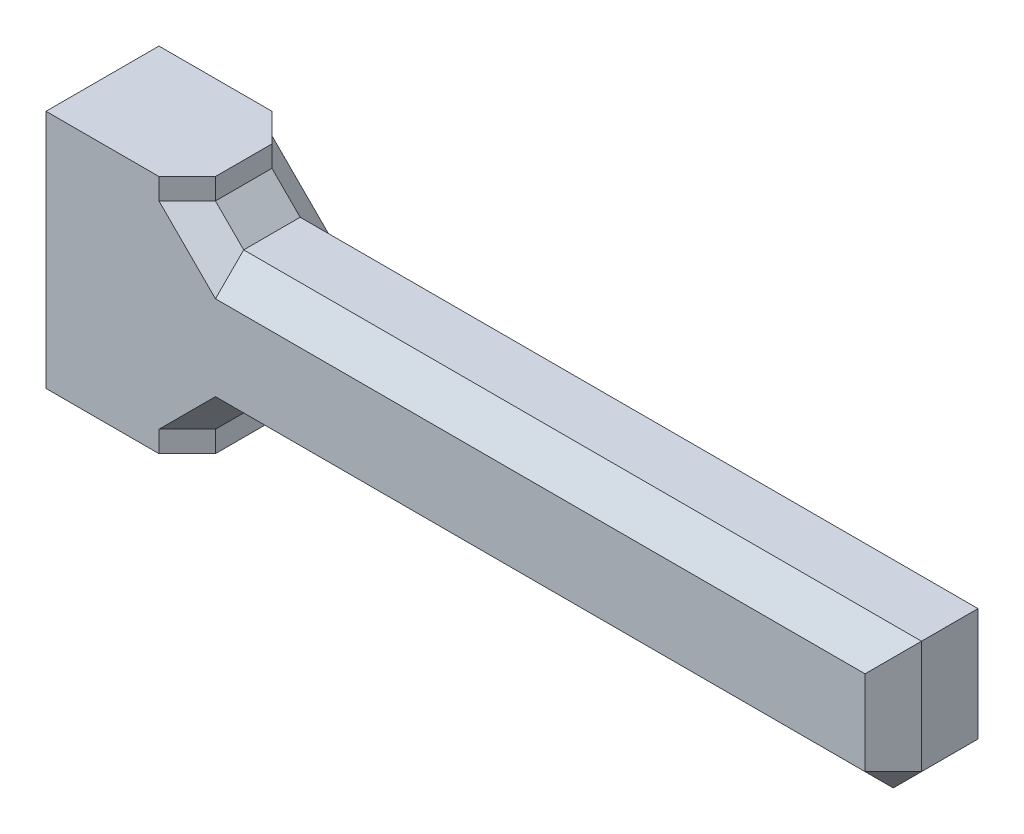
ISO-10303-21;
HEADER;
FILE_DESCRIPTION(('STEP AP214'),'2;1');
FILE_NAME('part.step','',(''),(''),'','','');
FILE_SCHEMA(('AUTOMOTIVE_DESIGN { 1 0 10303 214 1 1 1 1 }'));
ENDSEC;
DATA;
#1=APPLICATION_CONTEXT('core data for automotive mechanical design processes');
#2=APPLICATION_PROTOCOL_DEFINITION('international standard','automotive_design',2000,#1);
#3=PRODUCT_CONTEXT('',#1,'mechanical');
#4=PRODUCT('Part','Part','',(#3));
#5=PRODUCT_RELATED_PRODUCT_CATEGORY('part','',(#4));
#6=PRODUCT_DEFINITION_FORMATION('','',#4);
#7=PRODUCT_DEFINITION_CONTEXT('part definition',#1,'design');
#8=PRODUCT_DEFINITION('design','',#6,#7);
#9=PRODUCT_DEFINITION_SHAPE('','',#8);
#10=(LENGTH_UNIT() NAMED_UNIT(*) SI_UNIT(.MILLI.,.METRE.));
#11=(NAMED_UNIT(*) PLANE_ANGLE_UNIT() SI_UNIT($,.RADIAN.));
#12=(NAMED_UNIT(*) SI_UNIT($,.STERADIAN.) SOLID_ANGLE_UNIT());
#13=UNCERTAINTY_MEASURE_WITH_UNIT(LENGTH_MEASURE(1.E-05),#10,'distance_accuracy_value','');
#14=(GEOMETRIC_REPRESENTATION_CONTEXT(3) GLOBAL_UNCERTAINTY_ASSIGNED_CONTEXT((#13)) GLOBAL_UNIT_ASSIGNED_CONTEXT((#10,
#11,#12)) REPRESENTATION_CONTEXT('',''));
#15=CARTESIAN_POINT('',(0.,0.,0.));
#16=DIRECTION('',(0.,0.,1.));
#17=DIRECTION('',(1.,0.,0.));
#18=AXIS2_PLACEMENT_3D('',#15,#16,#17);
#19=CARTESIAN_POINT('',(0.,0.,0.));
#20=DIRECTION('',(0.,0.,-1.));
#21=DIRECTION('',(-1.,0.,0.));
#22=AXIS2_PLACEMENT_3D('',#19,#20,#21);
#23=PLANE('',#22);
#24=DIRECTION('',(0.707106781186551,0.707106781186544,0.));
#25=VECTOR('',#24,1.);
#26=CARTESIAN_POINT('',(1.25,-1.25000000000001,0.));
#27=LINE('',#26,#25);
#28=CARTESIAN_POINT('',(-1.00000000000001,-3.5,0.));
#29=VERTEX_POINT('',#28);
#30=CARTESIAN_POINT('',(0.,-2.5,0.));
#31=VERTEX_POINT('',#30);
#32=EDGE_CURVE('E221',#29,#31,#27,.T.);
#33=ORIENTED_EDGE('',*,*,#32,.F.);
#34=DIRECTION('',(0.,-1.,0.));
#35=VECTOR('',#34,1.);
#36=CARTESIAN_POINT('',(-1.00000000000001,-4.25,0.));
#37=LINE('',#36,#35);
#38=CARTESIAN_POINT('',(-1.00000000000001,-4.25,0.));
#39=VERTEX_POINT('',#38);
#40=EDGE_CURVE('E229',#29,#39,#37,.T.);
#41=ORIENTED_EDGE('',*,*,#40,.T.);
#42=DIRECTION('',(1.,0.,0.));
#43=VECTOR('',#42,1.);
#44=CARTESIAN_POINT('',(-5.,-4.25,0.));
#45=LINE('',#44,#43);
#46=CARTESIAN_POINT('',(-5.,-4.25,0.));
#47=VERTEX_POINT('',#46);
#48=EDGE_CURVE('E312',#47,#39,#45,.T.);
#49=ORIENTED_EDGE('',*,*,#48,.F.);
#50=DIRECTION('',(0.,-1.,0.));
#51=VECTOR('',#50,1.);
#52=CARTESIAN_POINT('',(-5.,4.25,0.));
#53=LINE('',#52,#51);
#54=CARTESIAN_POINT('',(-5.,4.25,0.));
#55=VERTEX_POINT('',#54);
#56=EDGE_CURVE('E316',#55,#47,#53,.T.);
#57=ORIENTED_EDGE('',*,*,#56,.F.);
#58=DIRECTION('',(-1.,0.,0.));
#59=VECTOR('',#58,1.);
#60=CARTESIAN_POINT('',(0.,4.25,0.));
#61=LINE('',#60,#59);
#62=CARTESIAN_POINT('',(-1.00000000000001,4.25,0.));
#63=VERTEX_POINT('',#62);
#64=EDGE_CURVE('E322',#63,#55,#61,.T.);
#65=ORIENTED_EDGE('',*,*,#64,.F.);
#66=DIRECTION('',(0.,-1.,0.));
#67=VECTOR('',#66,1.);
#68=CARTESIAN_POINT('',(-1.00000000000001,2.5,0.));
#69=LINE('',#68,#67);
#70=CARTESIAN_POINT('',(-1.00000000000001,3.50000000000002,0.));
#71=VERTEX_POINT('',#70);
#72=EDGE_CURVE('E227',#63,#71,#69,.T.);
#73=ORIENTED_EDGE('',*,*,#72,.T.);
#74=DIRECTION('',(-0.707106781186544,0.707106781186551,0.));
#75=VECTOR('',#74,1.);
#76=CARTESIAN_POINT('',(1.25,1.24999999999998,0.));
#77=LINE('',#76,#75);
#78=CARTESIAN_POINT('',(0.,2.5,0.));
#79=VERTEX_POINT('',#78);
#80=EDGE_CURVE('E224',#79,#71,#77,.T.);
#81=ORIENTED_EDGE('',*,*,#80,.F.);
#82=DIRECTION('',(-0.707106781186544,0.707106781186551,0.));
#83=VECTOR('',#82,1.);
#84=CARTESIAN_POINT('',(1.25,1.24999999999998,0.));
#85=LINE('',#84,#83);
#86=CARTESIAN_POINT('',(1.,1.49999999999999,0.));
#87=VERTEX_POINT('',#86);
#88=EDGE_CURVE('E215',#87,#79,#85,.T.);
#89=ORIENTED_EDGE('',*,*,#88,.F.);
#90=DIRECTION('',(1.,0.,0.));
#91=VECTOR('',#90,1.);
#92=CARTESIAN_POINT('',(0.,1.49999999999999,0.));
#93=LINE('',#92,#91);
#94=CARTESIAN_POINT('',(24.,1.49999999999999,0.));
#95=VERTEX_POINT('',#94);
#96=EDGE_CURVE('E209',#87,#95,#93,.T.);
#97=ORIENTED_EDGE('',*,*,#96,.T.);
#98=DIRECTION('',(0.,-1.,0.));
#99=VECTOR('',#98,1.);
#100=CARTESIAN_POINT('',(24.,0.,0.));
#101=LINE('',#100,#99);
#102=CARTESIAN_POINT('',(24.,-1.49999999999999,0.));
#103=VERTEX_POINT('',#102);
#104=EDGE_CURVE('E211',#95,#103,#101,.T.);
#105=ORIENTED_EDGE('',*,*,#104,.T.);
#106=DIRECTION('',(-1.,0.,0.));
#107=VECTOR('',#106,1.);
#108=CARTESIAN_POINT('',(0.,-1.49999999999999,0.));
#109=LINE('',#108,#107);
#110=CARTESIAN_POINT('',(1.00000000000001,-1.49999999999999,0.));
#111=VERTEX_POINT('',#110);
#112=EDGE_CURVE('E213',#103,#111,#109,.T.);
#113=ORIENTED_EDGE('',*,*,#112,.T.);
#114=DIRECTION('',(0.707106781186551,0.707106781186544,0.));
#115=VECTOR('',#114,1.);
#116=CARTESIAN_POINT('',(1.25,-1.25000000000001,0.));
#117=LINE('',#116,#115);
#118=EDGE_CURVE('E218',#31,#111,#117,.T.);
#119=ORIENTED_EDGE('',*,*,#118,.F.);
#120=EDGE_LOOP('',(#33,#41,#49,#57,#65,#73,#81,#89,#97,#105,#113,#119));
#121=FACE_BOUND('',#120,.T.);
#122=ADVANCED_FACE('F33',(#121),#23,.T.);
#123=CARTESIAN_POINT('',(0.,0.,4.));
#124=DIRECTION('',(0.,0.,-1.));
#125=DIRECTION('',(-1.,0.,0.));
#126=AXIS2_PLACEMENT_3D('',#123,#124,#125);
#127=PLANE('',#126);
#128=DIRECTION('',(1.,0.,0.));
#129=VECTOR('',#128,1.);
#130=CARTESIAN_POINT('',(-5.,-4.25,4.));
#131=LINE('',#130,#129);
#132=CARTESIAN_POINT('',(-5.,-4.25,4.));
#133=VERTEX_POINT('',#132);
#134=CARTESIAN_POINT('',(-1.00000000000001,-4.25,4.));
#135=VERTEX_POINT('',#134);
#136=EDGE_CURVE('E329',#133,#135,#131,.T.);
#137=ORIENTED_EDGE('',*,*,#136,.T.);
#138=DIRECTION('',(0.,1.,0.));
#139=VECTOR('',#138,1.);
#140=CARTESIAN_POINT('',(-1.00000000000001,0.,4.));
#141=LINE('',#140,#139);
#142=CARTESIAN_POINT('',(-1.00000000000001,-3.5,4.));
#143=VERTEX_POINT('',#142);
#144=EDGE_CURVE('E183',#135,#143,#141,.T.);
#145=ORIENTED_EDGE('',*,*,#144,.T.);
#146=DIRECTION('',(-0.707106781186551,-0.707106781186544,0.));
#147=VECTOR('',#146,1.);
#148=CARTESIAN_POINT('',(-1.00000000000001,-3.50000000000001,4.));
#149=LINE('',#148,#147);
#150=CARTESIAN_POINT('',(0.,-2.5,4.));
#151=VERTEX_POINT('',#150);
#152=EDGE_CURVE('E176',#151,#143,#149,.T.);
#153=ORIENTED_EDGE('',*,*,#152,.F.);
#154=DIRECTION('',(-0.707106781186551,-0.707106781186544,0.));
#155=VECTOR('',#154,1.);
#156=CARTESIAN_POINT('',(-1.00000000000001,-3.50000000000001,4.));
#157=LINE('',#156,#155);
#158=CARTESIAN_POINT('',(1.00000000000001,-1.5,4.));
#159=VERTEX_POINT('',#158);
#160=EDGE_CURVE('E180',#159,#151,#157,.T.);
#161=ORIENTED_EDGE('',*,*,#160,.F.);
#162=DIRECTION('',(1.,0.,0.));
#163=VECTOR('',#162,1.);
#164=CARTESIAN_POINT('',(25.,-1.5,4.));
#165=LINE('',#164,#163);
#166=CARTESIAN_POINT('',(24.,-1.5,4.));
#167=VERTEX_POINT('',#166);
#168=EDGE_CURVE('E194',#159,#167,#165,.T.);
#169=ORIENTED_EDGE('',*,*,#168,.T.);
#170=DIRECTION('',(0.,1.,0.));
#171=VECTOR('',#170,1.);
#172=CARTESIAN_POINT('',(24.,2.5,4.));
#173=LINE('',#172,#171);
#174=CARTESIAN_POINT('',(24.,1.49999999999999,4.));
#175=VERTEX_POINT('',#174);
#176=EDGE_CURVE('E351',#167,#175,#173,.T.);
#177=ORIENTED_EDGE('',*,*,#176,.T.);
#178=DIRECTION('',(-1.,0.,0.));
#179=VECTOR('',#178,1.);
#180=CARTESIAN_POINT('',(0.,1.49999999999999,4.));
#181=LINE('',#180,#179);
#182=CARTESIAN_POINT('',(1.,1.49999999999999,4.));
#183=VERTEX_POINT('',#182);
#184=EDGE_CURVE('E349',#175,#183,#181,.T.);
#185=ORIENTED_EDGE('',*,*,#184,.T.);
#186=DIRECTION('',(0.707106781186544,-0.707106781186551,0.));
#187=VECTOR('',#186,1.);
#188=CARTESIAN_POINT('',(1.,1.49999999999999,4.));
#189=LINE('',#188,#187);
#190=CARTESIAN_POINT('',(0.,2.5,4.));
#191=VERTEX_POINT('',#190);
#192=EDGE_CURVE('E332',#191,#183,#189,.T.);
#193=ORIENTED_EDGE('',*,*,#192,.F.);
#194=DIRECTION('',(0.707106781186544,-0.707106781186551,0.));
#195=VECTOR('',#194,1.);
#196=CARTESIAN_POINT('',(1.,1.49999999999999,4.));
#197=LINE('',#196,#195);
#198=CARTESIAN_POINT('',(-1.00000000000001,3.50000000000002,4.));
#199=VERTEX_POINT('',#198);
#200=EDGE_CURVE('E346',#199,#191,#197,.T.);
#201=ORIENTED_EDGE('',*,*,#200,.F.);
#202=DIRECTION('',(0.,1.,0.));
#203=VECTOR('',#202,1.);
#204=CARTESIAN_POINT('',(-1.00000000000001,0.,4.));
#205=LINE('',#204,#203);
#206=CARTESIAN_POINT('',(-1.00000000000001,4.25,4.));
#207=VERTEX_POINT('',#206);
#208=EDGE_CURVE('E192',#199,#207,#205,.T.);
#209=ORIENTED_EDGE('',*,*,#208,.T.);
#210=DIRECTION('',(-1.,0.,0.));
#211=VECTOR('',#210,1.);
#212=CARTESIAN_POINT('',(0.,4.25,4.));
#213=LINE('',#212,#211);
#214=CARTESIAN_POINT('',(-5.,4.25,4.));
#215=VERTEX_POINT('',#214);
#216=EDGE_CURVE('E325',#207,#215,#213,.T.);
#217=ORIENTED_EDGE('',*,*,#216,.T.);
#218=DIRECTION('',(0.,-1.,0.));
#219=VECTOR('',#218,1.);
#220=CARTESIAN_POINT('',(-5.,4.25,4.));
#221=LINE('',#220,#219);
#222=EDGE_CURVE('E429',#215,#133,#221,.T.);
#223=ORIENTED_EDGE('',*,*,#222,.T.);
#224=EDGE_LOOP('',(#137,#145,#153,#161,#169,#177,#185,#193,#201,#209,#217,#223));
#225=FACE_BOUND('',#224,.T.);
#226=ADVANCED_FACE('F179',(#225),#127,.F.);
#227=CARTESIAN_POINT('',(25.,2.5,4.));
#228=DIRECTION('',(1.,0.,0.));
#229=DIRECTION('',(0.,1.,0.));
#230=AXIS2_PLACEMENT_3D('',#227,#228,#229);
#231=PLANE('',#230);
#232=DIRECTION('',(0.,0.,-1.));
#233=VECTOR('',#232,1.);
#234=CARTESIAN_POINT('',(25.,-1.49999999999999,4.));
#235=LINE('',#234,#233);
#236=CARTESIAN_POINT('',(25.,-1.49999999999999,2.99999999999999));
#237=VERTEX_POINT('',#236);
#238=CARTESIAN_POINT('',(25.,-1.49999999999999,1.));
#239=VERTEX_POINT('',#238);
#240=EDGE_CURVE('E252',#237,#239,#235,.T.);
#241=ORIENTED_EDGE('',*,*,#240,.T.);
#242=DIRECTION('',(0.,1.,0.));
#243=VECTOR('',#242,1.);
#244=CARTESIAN_POINT('',(25.,2.5,1.));
#245=LINE('',#244,#243);
#246=CARTESIAN_POINT('',(25.,2.5,1.));
#247=VERTEX_POINT('',#246);
#248=EDGE_CURVE('E255',#239,#247,#245,.T.);
#249=ORIENTED_EDGE('',*,*,#248,.T.);
#250=DIRECTION('',(0.,0.,-1.));
#251=VECTOR('',#250,1.);
#252=CARTESIAN_POINT('',(25.,2.5,4.));
#253=LINE('',#252,#251);
#254=CARTESIAN_POINT('',(25.,2.5,3.));
#255=VERTEX_POINT('',#254);
#256=EDGE_CURVE('E330',#255,#247,#253,.T.);
#257=ORIENTED_EDGE('',*,*,#256,.F.);
#258=DIRECTION('',(0.,-1.,0.));
#259=VECTOR('',#258,1.);
#260=CARTESIAN_POINT('',(25.,-2.5,2.99999999999999));
#261=LINE('',#260,#259);
#262=EDGE_CURVE('E250',#255,#237,#261,.T.);
#263=ORIENTED_EDGE('',*,*,#262,.T.);
#264=EDGE_LOOP('',(#241,#249,#257,#263));
#265=FACE_BOUND('',#264,.T.);
#266=ADVANCED_FACE('F393',(#265),#231,.T.);
#267=CARTESIAN_POINT('',(0.,2.5,4.));
#268=DIRECTION('',(0.,1.,0.));
#269=DIRECTION('',(-1.,0.,0.));
#270=AXIS2_PLACEMENT_3D('',#267,#268,#269);
#271=PLANE('',#270);
#272=ORIENTED_EDGE('',*,*,#256,.T.);
#273=DIRECTION('',(-1.,0.,0.));
#274=VECTOR('',#273,1.);
#275=CARTESIAN_POINT('',(0.,2.5,1.));
#276=LINE('',#275,#274);
#277=CARTESIAN_POINT('',(1.,2.5,1.));
#278=VERTEX_POINT('',#277);
#279=EDGE_CURVE('E11',#247,#278,#276,.T.);
#280=ORIENTED_EDGE('',*,*,#279,.T.);
#281=DIRECTION('',(0.,0.,1.));
#282=VECTOR('',#281,1.);
#283=CARTESIAN_POINT('',(1.,2.5,4.));
#284=LINE('',#283,#282);
#285=CARTESIAN_POINT('',(1.,2.5,3.));
#286=VERTEX_POINT('',#285);
#287=EDGE_CURVE('E49',#278,#286,#284,.T.);
#288=ORIENTED_EDGE('',*,*,#287,.T.);
#289=DIRECTION('',(1.,0.,0.));
#290=VECTOR('',#289,1.);
#291=CARTESIAN_POINT('',(25.,2.5,3.));
#292=LINE('',#291,#290);
#293=EDGE_CURVE('E42',#286,#255,#292,.T.);
#294=ORIENTED_EDGE('',*,*,#293,.T.);
#295=EDGE_LOOP('',(#272,#280,#288,#294));
#296=FACE_BOUND('',#295,.T.);
#297=ADVANCED_FACE('F463',(#296),#271,.T.);
#298=CARTESIAN_POINT('',(0.,2.5,4.));
#299=DIRECTION('',(-1.,0.,0.));
#300=DIRECTION('',(0.,0.,1.));
#301=AXIS2_PLACEMENT_3D('',#298,#299,#300);
#302=PLANE('',#301);
#303=DIRECTION('',(0.,0.,-1.));
#304=VECTOR('',#303,1.);
#305=CARTESIAN_POINT('',(0.,3.50000000000002,4.));
#306=LINE('',#305,#304);
#307=CARTESIAN_POINT('',(0.,3.50000000000002,3.));
#308=VERTEX_POINT('',#307);
#309=CARTESIAN_POINT('',(0.,3.50000000000002,1.));
#310=VERTEX_POINT('',#309);
#311=EDGE_CURVE('E231',#308,#310,#306,.T.);
#312=ORIENTED_EDGE('',*,*,#311,.T.);
#313=DIRECTION('',(0.,1.,0.));
#314=VECTOR('',#313,1.);
#315=CARTESIAN_POINT('',(0.,4.25,1.));
#316=LINE('',#315,#314);
#317=CARTESIAN_POINT('',(0.,4.25,1.));
#318=VERTEX_POINT('',#317);
#319=EDGE_CURVE('E235',#310,#318,#316,.T.);
#320=ORIENTED_EDGE('',*,*,#319,.T.);
#321=DIRECTION('',(0.,0.,-1.));
#322=VECTOR('',#321,1.);
#323=CARTESIAN_POINT('',(0.,4.25,4.));
#324=LINE('',#323,#322);
#325=CARTESIAN_POINT('',(0.,4.25,3.));
#326=VERTEX_POINT('',#325);
#327=EDGE_CURVE('E333',#326,#318,#324,.T.);
#328=ORIENTED_EDGE('',*,*,#327,.F.);
#329=DIRECTION('',(0.,-1.,0.));
#330=VECTOR('',#329,1.);
#331=CARTESIAN_POINT('',(0.,2.5,3.));
#332=LINE('',#331,#330);
#333=EDGE_CURVE('E233',#326,#308,#332,.T.);
#334=ORIENTED_EDGE('',*,*,#333,.T.);
#335=EDGE_LOOP('',(#312,#320,#328,#334));
#336=FACE_BOUND('',#335,.T.);
#337=ADVANCED_FACE('F414',(#336),#302,.F.);
#338=CARTESIAN_POINT('',(0.,4.25,4.));
#339=DIRECTION('',(0.,-1.,0.));
#340=DIRECTION('',(0.,0.,-1.));
#341=AXIS2_PLACEMENT_3D('',#338,#339,#340);
#342=PLANE('',#341);
#343=ORIENTED_EDGE('',*,*,#327,.T.);
#344=DIRECTION('',(-0.707106781186551,0.,-0.707106781186544));
#345=VECTOR('',#344,1.);
#346=CARTESIAN_POINT('',(0.,4.25,1.));
#347=LINE('',#346,#345);
#348=EDGE_CURVE('E239',#318,#63,#347,.T.);
#349=ORIENTED_EDGE('',*,*,#348,.T.);
#350=ORIENTED_EDGE('',*,*,#64,.T.);
#351=DIRECTION('',(0.,0.,-1.));
#352=VECTOR('',#351,1.);
#353=CARTESIAN_POINT('',(-5.,4.25,4.));
#354=LINE('',#353,#352);
#355=EDGE_CURVE('E336',#215,#55,#354,.T.);
#356=ORIENTED_EDGE('',*,*,#355,.F.);
#357=ORIENTED_EDGE('',*,*,#216,.F.);
#358=DIRECTION('',(-0.707106781186551,0.,0.707106781186544));
#359=VECTOR('',#358,1.);
#360=CARTESIAN_POINT('',(-1.00000000000001,4.25,4.));
#361=LINE('',#360,#359);
#362=EDGE_CURVE('E237',#207,#326,#361,.F.);
#363=ORIENTED_EDGE('',*,*,#362,.T.);
#364=EDGE_LOOP('',(#343,#349,#350,#356,#357,#363));
#365=FACE_BOUND('',#364,.T.);
#366=ADVANCED_FACE('F410',(#365),#342,.F.);
#367=CARTESIAN_POINT('',(-5.,4.25,4.));
#368=DIRECTION('',(1.,0.,0.));
#369=DIRECTION('',(0.,0.,-1.));
#370=AXIS2_PLACEMENT_3D('',#367,#368,#369);
#371=PLANE('',#370);
#372=CARTESIAN_POINT('',(-5.,0.035876769306787,2.0256804813493));
#373=DIRECTION('',(-1.,0.,0.));
#374=DIRECTION('',(0.,0.,1.));
#375=AXIS2_PLACEMENT_3D('',#372,#373,#374);
#376=CIRCLE('',#375,1.5);
#377=CARTESIAN_POINT('',(-5.,0.035876769306787,3.5256804813493));
#378=VERTEX_POINT('',#377);
#379=EDGE_CURVE('E432',#378,#378,#376,.T.);
#380=ORIENTED_EDGE('',*,*,#379,.F.);
#381=EDGE_LOOP('',(#380));
#382=FACE_BOUND('',#381,.T.);
#383=ORIENTED_EDGE('',*,*,#56,.T.);
#384=DIRECTION('',(0.,0.,-1.));
#385=VECTOR('',#384,1.);
#386=CARTESIAN_POINT('',(-5.,-4.25,4.));
#387=LINE('',#386,#385);
#388=EDGE_CURVE('E339',#133,#47,#387,.T.);
#389=ORIENTED_EDGE('',*,*,#388,.F.);
#390=ORIENTED_EDGE('',*,*,#222,.F.);
#391=ORIENTED_EDGE('',*,*,#355,.T.);
#392=EDGE_LOOP('',(#383,#389,#390,#391));
#393=FACE_BOUND('',#392,.T.);
#394=ADVANCED_FACE('F423',(#382,#393),#371,.F.);
#395=CARTESIAN_POINT('',(-5.,-4.25,4.));
#396=DIRECTION('',(0.,1.,0.));
#397=DIRECTION('',(0.,0.,1.));
#398=AXIS2_PLACEMENT_3D('',#395,#396,#397);
#399=PLANE('',#398);
#400=DIRECTION('',(0.,0.,-1.));
#401=VECTOR('',#400,1.);
#402=CARTESIAN_POINT('',(0.,-4.25,4.));
#403=LINE('',#402,#401);
#404=CARTESIAN_POINT('',(0.,-4.25,3.));
#405=VERTEX_POINT('',#404);
#406=CARTESIAN_POINT('',(0.,-4.25,1.));
#407=VERTEX_POINT('',#406);
#408=EDGE_CURVE('E341',#405,#407,#403,.T.);
#409=ORIENTED_EDGE('',*,*,#408,.F.);
#410=DIRECTION('',(0.707106781186551,0.,-0.707106781186544));
#411=VECTOR('',#410,1.);
#412=CARTESIAN_POINT('',(-1.00000000000001,-4.25,4.));
#413=LINE('',#412,#411);
#414=EDGE_CURVE('E207',#405,#135,#413,.F.);
#415=ORIENTED_EDGE('',*,*,#414,.T.);
#416=ORIENTED_EDGE('',*,*,#136,.F.);
#417=ORIENTED_EDGE('',*,*,#388,.T.);
#418=ORIENTED_EDGE('',*,*,#48,.T.);
#419=DIRECTION('',(0.707106781186551,0.,0.707106781186544));
#420=VECTOR('',#419,1.);
#421=CARTESIAN_POINT('',(0.,-4.25,1.));
#422=LINE('',#421,#420);
#423=EDGE_CURVE('E205',#39,#407,#422,.T.);
#424=ORIENTED_EDGE('',*,*,#423,.T.);
#425=EDGE_LOOP('',(#409,#415,#416,#417,#418,#424));
#426=FACE_BOUND('',#425,.T.);
#427=ADVANCED_FACE('F427',(#426),#399,.F.);
#428=CARTESIAN_POINT('',(0.,-4.25,4.));
#429=DIRECTION('',(-1.,0.,0.));
#430=DIRECTION('',(0.,0.,1.));
#431=AXIS2_PLACEMENT_3D('',#428,#429,#430);
#432=PLANE('',#431);
#433=DIRECTION('',(0.,0.,1.));
#434=VECTOR('',#433,1.);
#435=CARTESIAN_POINT('',(0.,-3.5,4.));
#436=LINE('',#435,#434);
#437=CARTESIAN_POINT('',(0.,-3.5,1.));
#438=VERTEX_POINT('',#437);
#439=CARTESIAN_POINT('',(0.,-3.5,3.));
#440=VERTEX_POINT('',#439);
#441=EDGE_CURVE('E199',#438,#440,#436,.T.);
#442=ORIENTED_EDGE('',*,*,#441,.T.);
#443=DIRECTION('',(0.,-1.,0.));
#444=VECTOR('',#443,1.);
#445=CARTESIAN_POINT('',(0.,-4.25,3.));
#446=LINE('',#445,#444);
#447=EDGE_CURVE('E203',#440,#405,#446,.T.);
#448=ORIENTED_EDGE('',*,*,#447,.T.);
#449=ORIENTED_EDGE('',*,*,#408,.T.);
#450=DIRECTION('',(0.,1.,0.));
#451=VECTOR('',#450,1.);
#452=CARTESIAN_POINT('',(0.,-2.5,1.));
#453=LINE('',#452,#451);
#454=EDGE_CURVE('E201',#407,#438,#453,.T.);
#455=ORIENTED_EDGE('',*,*,#454,.T.);
#456=EDGE_LOOP('',(#442,#448,#449,#455));
#457=FACE_BOUND('',#456,.T.);
#458=ADVANCED_FACE('F453',(#457),#432,.F.);
#459=CARTESIAN_POINT('',(25.,-2.5,4.));
#460=DIRECTION('',(0.,-1.,0.));
#461=DIRECTION('',(1.,0.,0.));
#462=AXIS2_PLACEMENT_3D('',#459,#460,#461);
#463=PLANE('',#462);
#464=DIRECTION('',(-1.,0.,0.));
#465=VECTOR('',#464,1.);
#466=CARTESIAN_POINT('',(0.,-2.5,2.99999999999999));
#467=LINE('',#466,#465);
#468=CARTESIAN_POINT('',(24.,-2.5,2.99999999999999));
#469=VERTEX_POINT('',#468);
#470=CARTESIAN_POINT('',(1.00000000000001,-2.5,2.99999999999999));
#471=VERTEX_POINT('',#470);
#472=EDGE_CURVE('E245',#469,#471,#467,.T.);
#473=ORIENTED_EDGE('',*,*,#472,.T.);
#474=DIRECTION('',(0.,0.,-1.));
#475=VECTOR('',#474,1.);
#476=CARTESIAN_POINT('',(1.00000000000001,-2.5,4.));
#477=LINE('',#476,#475);
#478=CARTESIAN_POINT('',(1.00000000000001,-2.5,1.));
#479=VERTEX_POINT('',#478);
#480=EDGE_CURVE('E247',#471,#479,#477,.T.);
#481=ORIENTED_EDGE('',*,*,#480,.T.);
#482=DIRECTION('',(1.,0.,0.));
#483=VECTOR('',#482,1.);
#484=CARTESIAN_POINT('',(25.,-2.5,1.));
#485=LINE('',#484,#483);
#486=CARTESIAN_POINT('',(24.,-2.5,1.));
#487=VERTEX_POINT('',#486);
#488=EDGE_CURVE('E241',#479,#487,#485,.T.);
#489=ORIENTED_EDGE('',*,*,#488,.T.);
#490=DIRECTION('',(0.,0.,1.));
#491=VECTOR('',#490,1.);
#492=CARTESIAN_POINT('',(24.,-2.5,4.));
#493=LINE('',#492,#491);
#494=EDGE_CURVE('E243',#487,#469,#493,.T.);
#495=ORIENTED_EDGE('',*,*,#494,.T.);
#496=EDGE_LOOP('',(#473,#481,#489,#495));
#497=FACE_BOUND('',#496,.T.);
#498=ADVANCED_FACE('F368',(#497),#463,.T.);
#499=CARTESIAN_POINT('',(0.,2.5,1.));
#500=DIRECTION('',(0.707106781186544,0.,-0.707106781186551));
#501=DIRECTION('',(0.,-1.,0.));
#502=AXIS2_PLACEMENT_3D('',#499,#500,#501);
#503=PLANE('',#502);
#504=DIRECTION('',(0.707106781186551,0.,0.707106781186544));
#505=VECTOR('',#504,1.);
#506=CARTESIAN_POINT('',(-1.00000000000001,3.50000000000002,0.));
#507=LINE('',#506,#505);
#508=EDGE_CURVE('E37',#71,#310,#507,.T.);
#509=ORIENTED_EDGE('',*,*,#508,.F.);
#510=ORIENTED_EDGE('',*,*,#72,.F.);
#511=ORIENTED_EDGE('',*,*,#348,.F.);
#512=ORIENTED_EDGE('',*,*,#319,.F.);
#513=EDGE_LOOP('',(#509,#510,#511,#512));
#514=FACE_BOUND('',#513,.T.);
#515=ADVANCED_FACE('F35',(#514),#503,.T.);
#516=CARTESIAN_POINT('',(0.,3.50000000000002,1.));
#517=DIRECTION('',(0.577350269189626,0.57735026918962,-0.577350269189632));
#518=DIRECTION('',(-0.707106781186551,0.,-0.707106781186544));
#519=AXIS2_PLACEMENT_3D('',#516,#517,#518);
#520=PLANE('',#519);
#521=ORIENTED_EDGE('',*,*,#80,.T.);
#522=ORIENTED_EDGE('',*,*,#508,.T.);
#523=DIRECTION('',(0.707106781186544,-0.707106781186551,0.));
#524=VECTOR('',#523,1.);
#525=CARTESIAN_POINT('',(0.,3.50000000000002,1.));
#526=LINE('',#525,#524);
#527=EDGE_CURVE('E306',#278,#310,#526,.F.);
#528=ORIENTED_EDGE('',*,*,#527,.F.);
#529=DIRECTION('',(0.,-0.707106781186551,-0.707106781186544));
#530=VECTOR('',#529,1.);
#531=CARTESIAN_POINT('',(1.,2.5,1.));
#532=LINE('',#531,#530);
#533=EDGE_CURVE('E305',#87,#278,#532,.F.);
#534=ORIENTED_EDGE('',*,*,#533,.F.);
#535=ORIENTED_EDGE('',*,*,#88,.T.);
#536=EDGE_LOOP('',(#521,#522,#528,#534,#535));
#537=FACE_BOUND('',#536,.T.);
#538=ADVANCED_FACE('F510',(#537),#520,.T.);
#539=CARTESIAN_POINT('',(-1.00000000000001,0.,4.));
#540=DIRECTION('',(-0.707106781186544,0.,-0.707106781186551));
#541=DIRECTION('',(0.,1.,0.));
#542=AXIS2_PLACEMENT_3D('',#539,#540,#541);
#543=PLANE('',#542);
#544=ORIENTED_EDGE('',*,*,#362,.F.);
#545=ORIENTED_EDGE('',*,*,#208,.F.);
#546=DIRECTION('',(-0.707106781186551,0.,0.707106781186544));
#547=VECTOR('',#546,1.);
#548=CARTESIAN_POINT('',(0.,3.50000000000002,3.));
#549=LINE('',#548,#547);
#550=EDGE_CURVE('E302',#308,#199,#549,.T.);
#551=ORIENTED_EDGE('',*,*,#550,.F.);
#552=ORIENTED_EDGE('',*,*,#333,.F.);
#553=EDGE_LOOP('',(#544,#545,#551,#552));
#554=FACE_BOUND('',#553,.T.);
#555=ADVANCED_FACE('F406',(#554),#543,.F.);
#556=CARTESIAN_POINT('',(0.,3.50000000000002,4.));
#557=DIRECTION('',(-0.707106781186551,-0.707106781186544,0.));
#558=DIRECTION('',(0.,0.,-1.));
#559=AXIS2_PLACEMENT_3D('',#556,#557,#558);
#560=PLANE('',#559);
#561=ORIENTED_EDGE('',*,*,#527,.T.);
#562=ORIENTED_EDGE('',*,*,#311,.F.);
#563=DIRECTION('',(-0.707106781186544,0.707106781186551,0.));
#564=VECTOR('',#563,1.);
#565=CARTESIAN_POINT('',(1.,2.5,3.));
#566=LINE('',#565,#564);
#567=EDGE_CURVE('E299',#286,#308,#566,.T.);
#568=ORIENTED_EDGE('',*,*,#567,.F.);
#569=ORIENTED_EDGE('',*,*,#287,.F.);
#570=EDGE_LOOP('',(#561,#562,#568,#569));
#571=FACE_BOUND('',#570,.T.);
#572=ADVANCED_FACE('F526',(#571),#560,.F.);
#573=CARTESIAN_POINT('',(0.,1.49999999999999,0.));
#574=DIRECTION('',(0.,-0.707106781186544,0.707106781186551));
#575=DIRECTION('',(1.,0.,0.));
#576=AXIS2_PLACEMENT_3D('',#573,#574,#575);
#577=PLANE('',#576);
#578=ORIENTED_EDGE('',*,*,#533,.T.);
#579=ORIENTED_EDGE('',*,*,#279,.F.);
#580=DIRECTION('',(-0.577350269189628,-0.577350269189628,-0.577350269189622));
#581=VECTOR('',#580,1.);
#582=CARTESIAN_POINT('',(15.9999999999999,-6.50000000000006,-7.99999999999997));
#583=LINE('',#582,#581);
#584=EDGE_CURVE('E296',#95,#247,#583,.F.);
#585=ORIENTED_EDGE('',*,*,#584,.F.);
#586=ORIENTED_EDGE('',*,*,#96,.F.);
#587=EDGE_LOOP('',(#578,#579,#585,#586));
#588=FACE_BOUND('',#587,.T.);
#589=ADVANCED_FACE('F535',(#588),#577,.F.);
#590=CARTESIAN_POINT('',(1.,2.5,3.));
#591=DIRECTION('',(0.577350269189628,0.577350269189622,0.577350269189628));
#592=DIRECTION('',(0.707106781186548,0.,-0.707106781186547));
#593=AXIS2_PLACEMENT_3D('',#590,#591,#592);
#594=PLANE('',#593);
#595=ORIENTED_EDGE('',*,*,#200,.T.);
#596=ORIENTED_EDGE('',*,*,#192,.T.);
#597=DIRECTION('',(0.,0.707106781186551,-0.707106781186544));
#598=VECTOR('',#597,1.);
#599=CARTESIAN_POINT('',(1.,1.49999999999999,4.));
#600=LINE('',#599,#598);
#601=EDGE_CURVE('E293',#286,#183,#600,.F.);
#602=ORIENTED_EDGE('',*,*,#601,.F.);
#603=ORIENTED_EDGE('',*,*,#567,.T.);
#604=ORIENTED_EDGE('',*,*,#550,.T.);
#605=EDGE_LOOP('',(#595,#596,#602,#603,#604));
#606=FACE_BOUND('',#605,.T.);
#607=ADVANCED_FACE('F400',(#606),#594,.T.);
#608=CARTESIAN_POINT('',(24.,0.,0.));
#609=DIRECTION('',(-0.707106781186543,0.,0.707106781186552));
#610=DIRECTION('',(0.,-1.,0.));
#611=AXIS2_PLACEMENT_3D('',#608,#609,#610);
#612=PLANE('',#611);
#613=ORIENTED_EDGE('',*,*,#584,.T.);
#614=ORIENTED_EDGE('',*,*,#248,.F.);
#615=DIRECTION('',(-0.707106781186552,0.,-0.707106781186543));
#616=VECTOR('',#615,1.);
#617=CARTESIAN_POINT('',(25.,-1.49999999999999,1.));
#618=LINE('',#617,#616);
#619=EDGE_CURVE('E290',#103,#239,#618,.F.);
#620=ORIENTED_EDGE('',*,*,#619,.F.);
#621=ORIENTED_EDGE('',*,*,#104,.F.);
#622=EDGE_LOOP('',(#613,#614,#620,#621));
#623=FACE_BOUND('',#622,.T.);
#624=ADVANCED_FACE('F553',(#623),#612,.F.);
#625=CARTESIAN_POINT('',(0.,2.5,3.));
#626=DIRECTION('',(0.,0.707106781186544,0.707106781186551));
#627=DIRECTION('',(-1.,0.,0.));
#628=AXIS2_PLACEMENT_3D('',#625,#626,#627);
#629=PLANE('',#628);
#630=ORIENTED_EDGE('',*,*,#601,.T.);
#631=ORIENTED_EDGE('',*,*,#184,.F.);
#632=DIRECTION('',(0.577350269189619,0.577350269189632,-0.577350269189626));
#633=VECTOR('',#632,1.);
#634=CARTESIAN_POINT('',(16.6666666666669,-5.83333333333332,11.3333333333332));
#635=LINE('',#634,#633);
#636=EDGE_CURVE('E287',#255,#175,#635,.F.);
#637=ORIENTED_EDGE('',*,*,#636,.F.);
#638=ORIENTED_EDGE('',*,*,#293,.F.);
#639=EDGE_LOOP('',(#630,#631,#637,#638));
#640=FACE_BOUND('',#639,.T.);
#641=ADVANCED_FACE('F397',(#640),#629,.T.);
#642=CARTESIAN_POINT('',(25.,-1.49999999999999,1.));
#643=DIRECTION('',(0.577350269189626,-0.57735026918962,-0.577350269189632));
#644=DIRECTION('',(-0.707106781186551,0.,-0.707106781186544));
#645=AXIS2_PLACEMENT_3D('',#642,#643,#644);
#646=PLANE('',#645);
#647=DIRECTION('',(0.,-0.707106781186551,0.707106781186544));
#648=VECTOR('',#647,1.);
#649=CARTESIAN_POINT('',(24.,-2.,0.5));
#650=LINE('',#649,#648);
#651=EDGE_CURVE('E282',#103,#487,#650,.T.);
#652=ORIENTED_EDGE('',*,*,#651,.F.);
#653=ORIENTED_EDGE('',*,*,#619,.T.);
#654=DIRECTION('',(0.707106781186544,0.707106781186552,0.));
#655=VECTOR('',#654,1.);
#656=CARTESIAN_POINT('',(25.,-1.49999999999999,1.));
#657=LINE('',#656,#655);
#658=EDGE_CURVE('E285',#487,#239,#657,.T.);
#659=ORIENTED_EDGE('',*,*,#658,.F.);
#660=EDGE_LOOP('',(#652,#653,#659));
#661=FACE_BOUND('',#660,.T.);
#662=ADVANCED_FACE('F386',(#661),#646,.T.);
#663=CARTESIAN_POINT('',(25.,2.5,2.99999999999999));
#664=DIRECTION('',(0.707106781186552,0.,0.707106781186543));
#665=DIRECTION('',(0.,1.,0.));
#666=AXIS2_PLACEMENT_3D('',#663,#664,#665);
#667=PLANE('',#666);
#668=ORIENTED_EDGE('',*,*,#636,.T.);
#669=ORIENTED_EDGE('',*,*,#176,.F.);
#670=DIRECTION('',(-0.707106781186543,0.,0.707106781186552));
#671=VECTOR('',#670,1.);
#672=CARTESIAN_POINT('',(24.,-1.5,4.));
#673=LINE('',#672,#671);
#674=EDGE_CURVE('E279',#237,#167,#673,.T.);
#675=ORIENTED_EDGE('',*,*,#674,.F.);
#676=ORIENTED_EDGE('',*,*,#262,.F.);
#677=EDGE_LOOP('',(#668,#669,#675,#676));
#678=FACE_BOUND('',#677,.T.);
#679=ADVANCED_FACE('F357',(#678),#667,.T.);
#680=CARTESIAN_POINT('',(25.,-1.49999999999999,4.));
#681=DIRECTION('',(-0.707106781186551,0.707106781186543,0.));
#682=DIRECTION('',(0.,0.,-1.));
#683=AXIS2_PLACEMENT_3D('',#680,#681,#682);
#684=PLANE('',#683);
#685=ORIENTED_EDGE('',*,*,#658,.T.);
#686=ORIENTED_EDGE('',*,*,#240,.F.);
#687=DIRECTION('',(-0.707106781186543,-0.707106781186551,0.));
#688=VECTOR('',#687,1.);
#689=CARTESIAN_POINT('',(24.5,-2.,2.99999999999999));
#690=LINE('',#689,#688);
#691=EDGE_CURVE('E276',#469,#237,#690,.F.);
#692=ORIENTED_EDGE('',*,*,#691,.F.);
#693=ORIENTED_EDGE('',*,*,#494,.F.);
#694=EDGE_LOOP('',(#685,#686,#692,#693));
#695=FACE_BOUND('',#694,.T.);
#696=ADVANCED_FACE('F391',(#695),#684,.F.);
#697=CARTESIAN_POINT('',(0.,-1.49999999999999,0.));
#698=DIRECTION('',(0.,0.707106781186544,0.707106781186551));
#699=DIRECTION('',(-1.,0.,0.));
#700=AXIS2_PLACEMENT_3D('',#697,#698,#699);
#701=PLANE('',#700);
#702=ORIENTED_EDGE('',*,*,#651,.T.);
#703=ORIENTED_EDGE('',*,*,#488,.F.);
#704=DIRECTION('',(0.,-0.707106781186551,0.707106781186544));
#705=VECTOR('',#704,1.);
#706=CARTESIAN_POINT('',(1.00000000000001,-1.49999999999999,0.));
#707=LINE('',#706,#705);
#708=EDGE_CURVE('E273',#111,#479,#707,.T.);
#709=ORIENTED_EDGE('',*,*,#708,.F.);
#710=ORIENTED_EDGE('',*,*,#112,.F.);
#711=EDGE_LOOP('',(#702,#703,#709,#710));
#712=FACE_BOUND('',#711,.T.);
#713=ADVANCED_FACE('F382',(#712),#701,.F.);
#714=CARTESIAN_POINT('',(0.,-4.25,1.));
#715=DIRECTION('',(0.707106781186544,0.,-0.707106781186551));
#716=DIRECTION('',(0.,-1.,0.));
#717=AXIS2_PLACEMENT_3D('',#714,#715,#716);
#718=PLANE('',#717);
#719=ORIENTED_EDGE('',*,*,#423,.F.);
#720=ORIENTED_EDGE('',*,*,#40,.F.);
#721=DIRECTION('',(-0.707106781186551,0.,-0.707106781186544));
#722=VECTOR('',#721,1.);
#723=CARTESIAN_POINT('',(0.,-3.5,1.));
#724=LINE('',#723,#722);
#725=EDGE_CURVE('E270',#438,#29,#724,.T.);
#726=ORIENTED_EDGE('',*,*,#725,.F.);
#727=ORIENTED_EDGE('',*,*,#454,.F.);
#728=EDGE_LOOP('',(#719,#720,#726,#727));
#729=FACE_BOUND('',#728,.T.);
#730=ADVANCED_FACE('F603',(#729),#718,.T.);
#731=CARTESIAN_POINT('',(24.,-1.5,4.));
#732=DIRECTION('',(0.577350269189632,-0.577350269189626,0.57735026918962));
#733=DIRECTION('',(0.707106781186544,0.707106781186551,0.));
#734=AXIS2_PLACEMENT_3D('',#731,#732,#733);
#735=PLANE('',#734);
#736=ORIENTED_EDGE('',*,*,#691,.T.);
#737=ORIENTED_EDGE('',*,*,#674,.T.);
#738=DIRECTION('',(0.,-0.707106781186544,-0.707106781186551));
#739=VECTOR('',#738,1.);
#740=CARTESIAN_POINT('',(24.,-1.5,4.));
#741=LINE('',#740,#739);
#742=EDGE_CURVE('E267',#469,#167,#741,.F.);
#743=ORIENTED_EDGE('',*,*,#742,.F.);
#744=EDGE_LOOP('',(#736,#737,#743));
#745=FACE_BOUND('',#744,.T.);
#746=ADVANCED_FACE('F362',(#745),#735,.T.);
#747=CARTESIAN_POINT('',(1.00000000000001,-2.5,1.));
#748=DIRECTION('',(0.57735026918962,-0.577350269189626,-0.577350269189632));
#749=DIRECTION('',(0.,0.707106781186551,-0.707106781186544));
#750=AXIS2_PLACEMENT_3D('',#747,#748,#749);
#751=PLANE('',#750);
#752=ORIENTED_EDGE('',*,*,#118,.T.);
#753=ORIENTED_EDGE('',*,*,#708,.T.);
#754=DIRECTION('',(-0.707106781186551,-0.707106781186544,0.));
#755=VECTOR('',#754,1.);
#756=CARTESIAN_POINT('',(1.00000000000001,-2.5,1.));
#757=LINE('',#756,#755);
#758=EDGE_CURVE('E265',#438,#479,#757,.F.);
#759=ORIENTED_EDGE('',*,*,#758,.F.);
#760=ORIENTED_EDGE('',*,*,#725,.T.);
#761=ORIENTED_EDGE('',*,*,#32,.T.);
#762=EDGE_LOOP('',(#752,#753,#759,#760,#761));
#763=FACE_BOUND('',#762,.T.);
#764=ADVANCED_FACE('F379',(#763),#751,.T.);
#765=CARTESIAN_POINT('',(25.,-2.5,2.99999999999999));
#766=DIRECTION('',(0.,-0.707106781186551,0.707106781186544));
#767=DIRECTION('',(1.,0.,0.));
#768=AXIS2_PLACEMENT_3D('',#765,#766,#767);
#769=PLANE('',#768);
#770=ORIENTED_EDGE('',*,*,#742,.T.);
#771=ORIENTED_EDGE('',*,*,#168,.F.);
#772=DIRECTION('',(0.,0.707106781186544,0.707106781186551));
#773=VECTOR('',#772,1.);
#774=CARTESIAN_POINT('',(1.00000000000001,-2.5,2.99999999999999));
#775=LINE('',#774,#773);
#776=EDGE_CURVE('E191',#471,#159,#775,.T.);
#777=ORIENTED_EDGE('',*,*,#776,.F.);
#778=ORIENTED_EDGE('',*,*,#472,.F.);
#779=EDGE_LOOP('',(#770,#771,#777,#778));
#780=FACE_BOUND('',#779,.T.);
#781=ADVANCED_FACE('F365',(#780),#769,.T.);
#782=CARTESIAN_POINT('',(1.00000000000001,-2.5,4.));
#783=DIRECTION('',(-0.707106781186544,0.707106781186551,0.));
#784=DIRECTION('',(0.,0.,-1.));
#785=AXIS2_PLACEMENT_3D('',#782,#783,#784);
#786=PLANE('',#785);
#787=ORIENTED_EDGE('',*,*,#758,.T.);
#788=ORIENTED_EDGE('',*,*,#480,.F.);
#789=DIRECTION('',(0.707106781186551,0.707106781186544,0.));
#790=VECTOR('',#789,1.);
#791=CARTESIAN_POINT('',(0.,-3.50000000000001,3.));
#792=LINE('',#791,#790);
#793=EDGE_CURVE('E261',#440,#471,#792,.T.);
#794=ORIENTED_EDGE('',*,*,#793,.F.);
#795=ORIENTED_EDGE('',*,*,#441,.F.);
#796=EDGE_LOOP('',(#787,#788,#794,#795));
#797=FACE_BOUND('',#796,.T.);
#798=ADVANCED_FACE('F372',(#797),#786,.F.);
#799=CARTESIAN_POINT('',(0.,-3.5,3.));
#800=DIRECTION('',(0.577350269189624,-0.577350269189624,0.57735026918963));
#801=DIRECTION('',(0.707106781186551,0.,-0.707106781186544));
#802=AXIS2_PLACEMENT_3D('',#799,#800,#801);
#803=PLANE('',#802);
#804=ORIENTED_EDGE('',*,*,#160,.T.);
#805=ORIENTED_EDGE('',*,*,#152,.T.);
#806=DIRECTION('',(0.707106781186551,0.,-0.707106781186544));
#807=VECTOR('',#806,1.);
#808=CARTESIAN_POINT('',(-1.00000000000001,-3.5,4.));
#809=LINE('',#808,#807);
#810=EDGE_CURVE('E259',#440,#143,#809,.F.);
#811=ORIENTED_EDGE('',*,*,#810,.F.);
#812=ORIENTED_EDGE('',*,*,#793,.T.);
#813=ORIENTED_EDGE('',*,*,#776,.T.);
#814=EDGE_LOOP('',(#804,#805,#811,#812,#813));
#815=FACE_BOUND('',#814,.T.);
#816=ADVANCED_FACE('F188',(#815),#803,.T.);
#817=CARTESIAN_POINT('',(-1.00000000000001,0.,4.));
#818=DIRECTION('',(-0.707106781186544,0.,-0.707106781186551));
#819=DIRECTION('',(0.,1.,0.));
#820=AXIS2_PLACEMENT_3D('',#817,#818,#819);
#821=PLANE('',#820);
#822=ORIENTED_EDGE('',*,*,#414,.F.);
#823=ORIENTED_EDGE('',*,*,#447,.F.);
#824=ORIENTED_EDGE('',*,*,#810,.T.);
#825=ORIENTED_EDGE('',*,*,#144,.F.);
#826=EDGE_LOOP('',(#822,#823,#824,#825));
#827=FACE_BOUND('',#826,.T.);
#828=ADVANCED_FACE('F443',(#827),#821,.F.);
#829=CARTESIAN_POINT('',(-2.5,0.035876769306787,2.0256804813493));
#830=DIRECTION('',(-1.,0.,0.));
#831=DIRECTION('',(0.,0.,1.));
#832=AXIS2_PLACEMENT_3D('',#829,#830,#831);
#833=CYLINDRICAL_SURFACE('',#832,1.5);
#834=CARTESIAN_POINT('',(-2.5,0.035876769306787,2.0256804813493));
#835=DIRECTION('',(-1.,0.,0.));
#836=DIRECTION('',(0.,0.,1.));
#837=AXIS2_PLACEMENT_3D('',#834,#835,#836);
#838=CIRCLE('',#837,1.5);
#839=CARTESIAN_POINT('',(-2.5,0.035876769306787,3.5256804813493));
#840=VERTEX_POINT('',#839);
#841=EDGE_CURVE('E262',#840,#840,#838,.T.);
#842=ORIENTED_EDGE('',*,*,#841,.F.);
#843=EDGE_LOOP('',(#842));
#844=FACE_BOUND('',#843,.T.);
#845=ORIENTED_EDGE('',*,*,#379,.T.);
#846=EDGE_LOOP('',(#845));
#847=FACE_BOUND('',#846,.T.);
#848=ADVANCED_FACE('F440',(#844,#847),#833,.F.);
#849=CARTESIAN_POINT('',(-2.5,0.035876769306787,2.0256804813493));
#850=DIRECTION('',(-1.,0.,0.));
#851=DIRECTION('',(0.,0.,1.));
#852=AXIS2_PLACEMENT_3D('',#849,#850,#851);
#853=PLANE('',#852);
#854=ORIENTED_EDGE('',*,*,#841,.T.);
#855=EDGE_LOOP('',(#854));
#856=FACE_BOUND('',#855,.T.);
#857=ADVANCED_FACE('F438',(#856),#853,.T.);
#858=CLOSED_SHELL('',(#122,#226,#266,#297,#337,#366,#394,#427,#458,#498,#515,#538,#555,#572,
#589,#607,#624,#641,#662,#679,#696,#713,#730,#746,#764,#781,#798,#816,#828,#848,#857));
#859=MANIFOLD_SOLID_BREP('B2',#858);
#860=ADVANCED_BREP_SHAPE_REPRESENTATION('',(#18,#859),#14);
#861=SHAPE_DEFINITION_REPRESENTATION(#9,#860);
ENDSEC;
END-ISO-10303-21;
